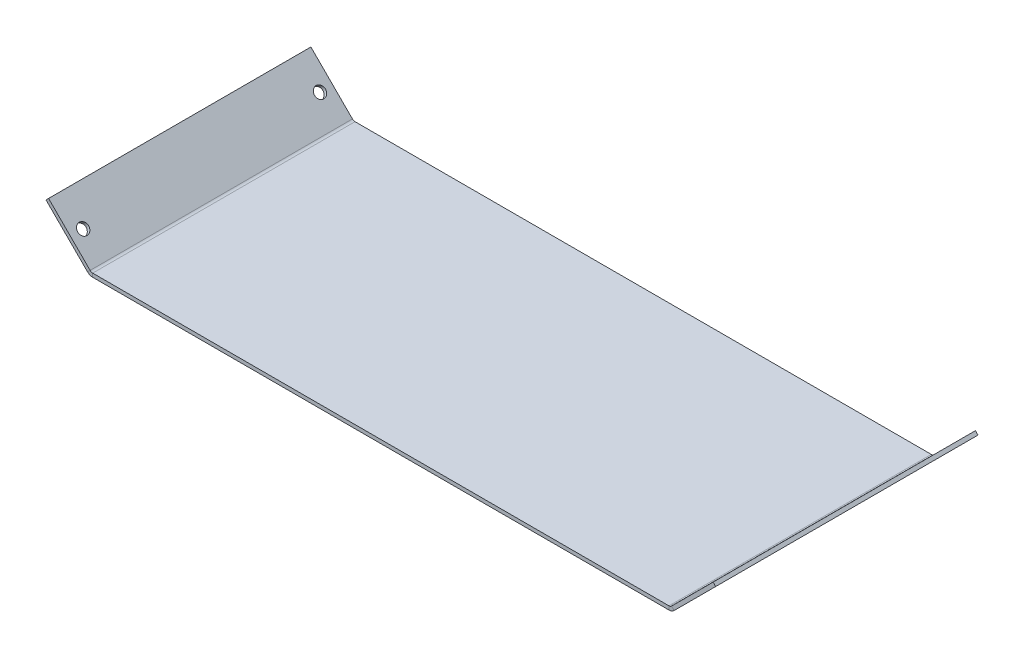
ISO-10303-21;
HEADER;
FILE_DESCRIPTION(('STEP AP214'),'2;1');
FILE_NAME('part.step','',(''),(''),'','','');
FILE_SCHEMA(('AUTOMOTIVE_DESIGN { 1 0 10303 214 1 1 1 1 }'));
ENDSEC;
DATA;
#1=APPLICATION_CONTEXT('core data for automotive mechanical design processes');
#2=APPLICATION_PROTOCOL_DEFINITION('international standard','automotive_design',2000,#1);
#3=PRODUCT_CONTEXT('',#1,'mechanical');
#4=PRODUCT('Part','Part','',(#3));
#5=PRODUCT_RELATED_PRODUCT_CATEGORY('part','',(#4));
#6=PRODUCT_DEFINITION_FORMATION('','',#4);
#7=PRODUCT_DEFINITION_CONTEXT('part definition',#1,'design');
#8=PRODUCT_DEFINITION('design','',#6,#7);
#9=PRODUCT_DEFINITION_SHAPE('','',#8);
#10=(LENGTH_UNIT() NAMED_UNIT(*) SI_UNIT(.MILLI.,.METRE.));
#11=(NAMED_UNIT(*) PLANE_ANGLE_UNIT() SI_UNIT($,.RADIAN.));
#12=(NAMED_UNIT(*) SI_UNIT($,.STERADIAN.) SOLID_ANGLE_UNIT());
#13=UNCERTAINTY_MEASURE_WITH_UNIT(LENGTH_MEASURE(1.E-05),#10,'distance_accuracy_value','');
#14=(GEOMETRIC_REPRESENTATION_CONTEXT(3) GLOBAL_UNCERTAINTY_ASSIGNED_CONTEXT((#13)) GLOBAL_UNIT_ASSIGNED_CONTEXT((#10,
#11,#12)) REPRESENTATION_CONTEXT('',''));
#15=CARTESIAN_POINT('',(0.,0.,0.));
#16=DIRECTION('',(0.,0.,1.));
#17=DIRECTION('',(1.,0.,0.));
#18=AXIS2_PLACEMENT_3D('',#15,#16,#17);
#19=CARTESIAN_POINT('',(0.,-3.175,0.));
#20=DIRECTION('',(0.,1.,0.));
#21=DIRECTION('',(0.,0.,1.));
#22=AXIS2_PLACEMENT_3D('',#19,#20,#21);
#23=PLANE('',#22);
#24=DIRECTION('',(0.,0.,1.));
#25=VECTOR('',#24,1.);
#26=CARTESIAN_POINT('',(-502.194743878931,-3.17500000000002,228.6));
#27=LINE('',#26,#25);
#28=CARTESIAN_POINT('',(-502.194743878931,-3.17500000000002,228.6));
#29=VERTEX_POINT('',#28);
#30=CARTESIAN_POINT('',(-502.194743878931,-3.175,-228.6));
#31=VERTEX_POINT('',#30);
#32=EDGE_CURVE('E142',#29,#31,#27,.F.);
#33=ORIENTED_EDGE('',*,*,#32,.T.);
#34=DIRECTION('',(-1.,0.,0.));
#35=VECTOR('',#34,1.);
#36=CARTESIAN_POINT('',(504.825,-3.175,-228.6));
#37=LINE('',#36,#35);
#38=CARTESIAN_POINT('',(502.194743878931,-3.17499999999999,-228.6));
#39=VERTEX_POINT('',#38);
#40=EDGE_CURVE('E11',#39,#31,#37,.T.);
#41=ORIENTED_EDGE('',*,*,#40,.F.);
#42=DIRECTION('',(0.,0.,-1.));
#43=VECTOR('',#42,1.);
#44=CARTESIAN_POINT('',(502.194743878931,-3.17499999999999,-228.6));
#45=LINE('',#44,#43);
#46=CARTESIAN_POINT('',(502.194743878931,-3.175,228.6));
#47=VERTEX_POINT('',#46);
#48=EDGE_CURVE('E233',#39,#47,#45,.F.);
#49=ORIENTED_EDGE('',*,*,#48,.T.);
#50=DIRECTION('',(1.,0.,0.));
#51=VECTOR('',#50,1.);
#52=CARTESIAN_POINT('',(504.825,-3.175,228.6));
#53=LINE('',#52,#51);
#54=EDGE_CURVE('E52',#29,#47,#53,.T.);
#55=ORIENTED_EDGE('',*,*,#54,.F.);
#56=EDGE_LOOP('',(#33,#41,#49,#55));
#57=FACE_BOUND('',#56,.T.);
#58=ADVANCED_FACE('F43',(#57),#23,.F.);
#59=CARTESIAN_POINT('',(0.,3.175,0.));
#60=DIRECTION('',(0.,1.,0.));
#61=DIRECTION('',(0.,0.,1.));
#62=AXIS2_PLACEMENT_3D('',#59,#60,#61);
#63=PLANE('',#62);
#64=DIRECTION('',(-1.,0.,0.));
#65=VECTOR('',#64,1.);
#66=CARTESIAN_POINT('',(504.825,3.175,-228.6));
#67=LINE('',#66,#65);
#68=CARTESIAN_POINT('',(502.194743878931,3.175,-228.6));
#69=VERTEX_POINT('',#68);
#70=CARTESIAN_POINT('',(-502.194743878931,3.17499999999998,-228.6));
#71=VERTEX_POINT('',#70);
#72=EDGE_CURVE('E47',#69,#71,#67,.T.);
#73=ORIENTED_EDGE('',*,*,#72,.T.);
#74=DIRECTION('',(0.,0.,1.));
#75=VECTOR('',#74,1.);
#76=CARTESIAN_POINT('',(-502.194743878931,3.17499999999998,228.6));
#77=LINE('',#76,#75);
#78=CARTESIAN_POINT('',(-502.194743878931,3.17499999999998,228.6));
#79=VERTEX_POINT('',#78);
#80=EDGE_CURVE('E192',#79,#71,#77,.F.);
#81=ORIENTED_EDGE('',*,*,#80,.F.);
#82=DIRECTION('',(1.,0.,0.));
#83=VECTOR('',#82,1.);
#84=CARTESIAN_POINT('',(504.825,3.175,228.6));
#85=LINE('',#84,#83);
#86=CARTESIAN_POINT('',(502.194743878931,3.17500000000001,228.6));
#87=VERTEX_POINT('',#86);
#88=EDGE_CURVE('E251',#79,#87,#85,.T.);
#89=ORIENTED_EDGE('',*,*,#88,.T.);
#90=DIRECTION('',(0.,0.,-1.));
#91=VECTOR('',#90,1.);
#92=CARTESIAN_POINT('',(502.194743878931,3.17500000000001,-228.6));
#93=LINE('',#92,#91);
#94=EDGE_CURVE('E60',#69,#87,#93,.F.);
#95=ORIENTED_EDGE('',*,*,#94,.F.);
#96=EDGE_LOOP('',(#73,#81,#89,#95));
#97=FACE_BOUND('',#96,.T.);
#98=ADVANCED_FACE('F255',(#97),#63,.T.);
#99=CARTESIAN_POINT('',(504.825,-3.175,228.6));
#100=DIRECTION('',(0.,0.,1.));
#101=DIRECTION('',(1.,0.,0.));
#102=AXIS2_PLACEMENT_3D('',#99,#100,#101);
#103=PLANE('',#102);
#104=ORIENTED_EDGE('',*,*,#88,.F.);
#105=DIRECTION('',(0.,-1.,0.));
#106=VECTOR('',#105,1.);
#107=CARTESIAN_POINT('',(-502.194743878931,3.17499999999998,228.6));
#108=LINE('',#107,#106);
#109=EDGE_CURVE('E188',#79,#29,#108,.T.);
#110=ORIENTED_EDGE('',*,*,#109,.T.);
#111=ORIENTED_EDGE('',*,*,#54,.T.);
#112=DIRECTION('',(0.,-1.,0.));
#113=VECTOR('',#112,1.);
#114=CARTESIAN_POINT('',(502.194743878931,3.17500000000001,228.6));
#115=LINE('',#114,#113);
#116=EDGE_CURVE('E248',#87,#47,#115,.T.);
#117=ORIENTED_EDGE('',*,*,#116,.F.);
#118=EDGE_LOOP('',(#104,#110,#111,#117));
#119=FACE_BOUND('',#118,.T.);
#120=ADVANCED_FACE('F45',(#119),#103,.T.);
#121=CARTESIAN_POINT('',(504.825,-3.175,-228.6));
#122=DIRECTION('',(0.,0.,-1.));
#123=DIRECTION('',(-1.,0.,0.));
#124=AXIS2_PLACEMENT_3D('',#121,#122,#123);
#125=PLANE('',#124);
#126=DIRECTION('',(0.,-1.,0.));
#127=VECTOR('',#126,1.);
#128=CARTESIAN_POINT('',(-502.194743878931,3.17499999999998,-228.6));
#129=LINE('',#128,#127);
#130=EDGE_CURVE('E196',#71,#31,#129,.T.);
#131=ORIENTED_EDGE('',*,*,#130,.F.);
#132=ORIENTED_EDGE('',*,*,#72,.F.);
#133=DIRECTION('',(0.,-1.,0.));
#134=VECTOR('',#133,1.);
#135=CARTESIAN_POINT('',(502.194743878931,3.17500000000001,-228.6));
#136=LINE('',#135,#134);
#137=EDGE_CURVE('E239',#69,#39,#136,.T.);
#138=ORIENTED_EDGE('',*,*,#137,.T.);
#139=ORIENTED_EDGE('',*,*,#40,.T.);
#140=EDGE_LOOP('',(#131,#132,#138,#139));
#141=FACE_BOUND('',#140,.T.);
#142=ADVANCED_FACE('F305',(#141),#125,.T.);
#143=CARTESIAN_POINT('',(502.194743878931,9.525,228.6));
#144=DIRECTION('',(0.,0.,1.));
#145=DIRECTION('',(1.,0.,0.));
#146=AXIS2_PLACEMENT_3D('',#143,#144,#145);
#147=PLANE('',#146);
#148=DIRECTION('',(0.707106781186543,-0.707106781186551,0.));
#149=VECTOR('',#148,1.);
#150=CARTESIAN_POINT('',(506.684871939465,5.03487193946545,228.6));
#151=LINE('',#150,#149);
#152=CARTESIAN_POINT('',(506.684871939465,5.03487193946541,228.6));
#153=VERTEX_POINT('',#152);
#154=CARTESIAN_POINT('',(511.175,0.544743878930762,228.6));
#155=VERTEX_POINT('',#154);
#156=EDGE_CURVE('E199',#153,#155,#151,.T.);
#157=ORIENTED_EDGE('',*,*,#156,.F.);
#158=CARTESIAN_POINT('',(502.194743878931,9.525,228.6));
#159=DIRECTION('',(0.,0.,-1.));
#160=DIRECTION('',(-1.,0.,0.));
#161=AXIS2_PLACEMENT_3D('',#158,#159,#160);
#162=CIRCLE('',#161,6.34999999999999);
#163=EDGE_CURVE('E242',#87,#153,#162,.F.);
#164=ORIENTED_EDGE('',*,*,#163,.F.);
#165=ORIENTED_EDGE('',*,*,#116,.T.);
#166=CARTESIAN_POINT('',(502.194743878931,9.525,228.6));
#167=DIRECTION('',(0.,0.,-1.));
#168=DIRECTION('',(-1.,0.,0.));
#169=AXIS2_PLACEMENT_3D('',#166,#167,#168);
#170=CIRCLE('',#169,12.7);
#171=EDGE_CURVE('E235',#47,#155,#170,.F.);
#172=ORIENTED_EDGE('',*,*,#171,.T.);
#173=EDGE_LOOP('',(#157,#164,#165,#172));
#174=FACE_BOUND('',#173,.T.);
#175=ADVANCED_FACE('F307',(#174),#147,.T.);
#176=CARTESIAN_POINT('',(502.194743878931,9.525,-228.6));
#177=DIRECTION('',(0.,0.,1.));
#178=DIRECTION('',(1.,0.,0.));
#179=AXIS2_PLACEMENT_3D('',#176,#177,#178);
#180=PLANE('',#179);
#181=CARTESIAN_POINT('',(502.194743878931,9.525,-228.6));
#182=DIRECTION('',(0.,0.,-1.));
#183=DIRECTION('',(-1.,0.,0.));
#184=AXIS2_PLACEMENT_3D('',#181,#182,#183);
#185=CIRCLE('',#184,6.34999999999999);
#186=CARTESIAN_POINT('',(506.684871939465,5.03487193946541,-228.6));
#187=VERTEX_POINT('',#186);
#188=EDGE_CURVE('E230',#187,#69,#185,.T.);
#189=ORIENTED_EDGE('',*,*,#188,.F.);
#190=DIRECTION('',(0.707106781186543,-0.707106781186551,0.));
#191=VECTOR('',#190,1.);
#192=CARTESIAN_POINT('',(506.684871939465,5.03487193946545,-228.6));
#193=LINE('',#192,#191);
#194=CARTESIAN_POINT('',(511.175,0.5447438789308,-228.6));
#195=VERTEX_POINT('',#194);
#196=EDGE_CURVE('E203',#187,#195,#193,.T.);
#197=ORIENTED_EDGE('',*,*,#196,.T.);
#198=CARTESIAN_POINT('',(502.194743878931,9.525,-228.6));
#199=DIRECTION('',(0.,0.,-1.));
#200=DIRECTION('',(-1.,0.,0.));
#201=AXIS2_PLACEMENT_3D('',#198,#199,#200);
#202=CIRCLE('',#201,12.7);
#203=EDGE_CURVE('E236',#195,#39,#202,.T.);
#204=ORIENTED_EDGE('',*,*,#203,.T.);
#205=ORIENTED_EDGE('',*,*,#137,.F.);
#206=EDGE_LOOP('',(#189,#197,#204,#205));
#207=FACE_BOUND('',#206,.T.);
#208=ADVANCED_FACE('F303',(#207),#180,.F.);
#209=CARTESIAN_POINT('',(502.194743878931,9.525,-228.6));
#210=DIRECTION('',(0.,0.,-1.));
#211=DIRECTION('',(0.707106781186544,-0.707106781186551,0.));
#212=AXIS2_PLACEMENT_3D('',#209,#210,#211);
#213=CYLINDRICAL_SURFACE('',#212,12.7);
#214=ORIENTED_EDGE('',*,*,#48,.F.);
#215=ORIENTED_EDGE('',*,*,#203,.F.);
#216=DIRECTION('',(0.,0.,-1.));
#217=VECTOR('',#216,1.);
#218=CARTESIAN_POINT('',(511.175,0.544743878930776,0.));
#219=LINE('',#218,#217);
#220=EDGE_CURVE('E206',#155,#195,#219,.T.);
#221=ORIENTED_EDGE('',*,*,#220,.F.);
#222=ORIENTED_EDGE('',*,*,#171,.F.);
#223=EDGE_LOOP('',(#214,#215,#221,#222));
#224=FACE_BOUND('',#223,.T.);
#225=ADVANCED_FACE('F340',(#224),#213,.T.);
#226=CARTESIAN_POINT('',(502.194743878931,9.525,-228.6));
#227=DIRECTION('',(0.,0.,-1.));
#228=DIRECTION('',(0.707106781186544,-0.707106781186551,0.));
#229=AXIS2_PLACEMENT_3D('',#226,#227,#228);
#230=CYLINDRICAL_SURFACE('',#229,6.34999999999999);
#231=ORIENTED_EDGE('',*,*,#94,.T.);
#232=ORIENTED_EDGE('',*,*,#163,.T.);
#233=DIRECTION('',(0.,0.,-1.));
#234=VECTOR('',#233,1.);
#235=CARTESIAN_POINT('',(506.684871939465,5.03487193946545,228.6));
#236=LINE('',#235,#234);
#237=EDGE_CURVE('E201',#153,#187,#236,.T.);
#238=ORIENTED_EDGE('',*,*,#237,.T.);
#239=ORIENTED_EDGE('',*,*,#188,.T.);
#240=EDGE_LOOP('',(#231,#232,#238,#239));
#241=FACE_BOUND('',#240,.T.);
#242=ADVANCED_FACE('F317',(#241),#230,.F.);
#243=CARTESIAN_POINT('',(509.315128060534,-1.31512806053462,-228.6));
#244=DIRECTION('',(0.,0.,-1.));
#245=DIRECTION('',(-1.,0.,0.));
#246=AXIS2_PLACEMENT_3D('',#243,#244,#245);
#247=PLANE('',#246);
#248=DIRECTION('',(-0.707106781186551,-0.707106781186543,0.));
#249=VECTOR('',#248,1.);
#250=CARTESIAN_POINT('',(509.315128060534,-1.31512806053462,-228.6));
#251=LINE('',#250,#249);
#252=CARTESIAN_POINT('',(583.607828027736,72.977571906666,-228.6));
#253=VERTEX_POINT('',#252);
#254=EDGE_CURVE('E218',#253,#195,#251,.T.);
#255=ORIENTED_EDGE('',*,*,#254,.T.);
#256=ORIENTED_EDGE('',*,*,#196,.F.);
#257=DIRECTION('',(-0.707106781186551,-0.707106781186543,0.));
#258=VECTOR('',#257,1.);
#259=CARTESIAN_POINT('',(504.825,3.17499999999998,-228.6));
#260=LINE('',#259,#258);
#261=CARTESIAN_POINT('',(579.117699967201,77.4676999672006,-228.6));
#262=VERTEX_POINT('',#261);
#263=EDGE_CURVE('E215',#262,#187,#260,.T.);
#264=ORIENTED_EDGE('',*,*,#263,.F.);
#265=DIRECTION('',(-0.707106781186544,0.707106781186551,0.));
#266=VECTOR('',#265,1.);
#267=CARTESIAN_POINT('',(583.607828027736,72.977571906666,-228.6));
#268=LINE('',#267,#266);
#269=EDGE_CURVE('E228',#253,#262,#268,.T.);
#270=ORIENTED_EDGE('',*,*,#269,.F.);
#271=EDGE_LOOP('',(#255,#256,#264,#270));
#272=FACE_BOUND('',#271,.T.);
#273=ADVANCED_FACE('F337',(#272),#247,.T.);
#274=CARTESIAN_POINT('',(583.607828027736,72.977571906666,228.6));
#275=DIRECTION('',(0.,0.,1.));
#276=DIRECTION('',(1.,0.,0.));
#277=AXIS2_PLACEMENT_3D('',#274,#275,#276);
#278=PLANE('',#277);
#279=DIRECTION('',(0.707106781186551,0.707106781186543,0.));
#280=VECTOR('',#279,1.);
#281=CARTESIAN_POINT('',(579.117699967201,77.4676999672006,228.6));
#282=LINE('',#281,#280);
#283=CARTESIAN_POINT('',(579.117699967201,77.4676999672006,228.6));
#284=VERTEX_POINT('',#283);
#285=EDGE_CURVE('E211',#153,#284,#282,.T.);
#286=ORIENTED_EDGE('',*,*,#285,.F.);
#287=ORIENTED_EDGE('',*,*,#156,.T.);
#288=DIRECTION('',(0.707106781186551,0.707106781186543,0.));
#289=VECTOR('',#288,1.);
#290=CARTESIAN_POINT('',(583.607828027736,72.977571906666,228.6));
#291=LINE('',#290,#289);
#292=CARTESIAN_POINT('',(583.607828027736,72.977571906666,228.6));
#293=VERTEX_POINT('',#292);
#294=EDGE_CURVE('E212',#155,#293,#291,.T.);
#295=ORIENTED_EDGE('',*,*,#294,.T.);
#296=DIRECTION('',(-0.707106781186544,0.707106781186551,0.));
#297=VECTOR('',#296,1.);
#298=CARTESIAN_POINT('',(583.607828027736,72.977571906666,228.6));
#299=LINE('',#298,#297);
#300=EDGE_CURVE('E221',#293,#284,#299,.T.);
#301=ORIENTED_EDGE('',*,*,#300,.T.);
#302=EDGE_LOOP('',(#286,#287,#295,#301));
#303=FACE_BOUND('',#302,.T.);
#304=ADVANCED_FACE('F323',(#303),#278,.T.);
#305=CARTESIAN_POINT('',(255.315128060532,-255.315128060535,0.));
#306=DIRECTION('',(0.707106781186544,-0.707106781186551,0.));
#307=DIRECTION('',(0.707106781186551,0.707106781186544,0.));
#308=AXIS2_PLACEMENT_3D('',#305,#306,#307);
#309=PLANE('',#308);
#310=CARTESIAN_POINT('',(545.531542074402,34.9012859533329,206.375));
#311=DIRECTION('',(0.707106781186544,-0.707106781186551,0.));
#312=DIRECTION('',(0.707106781186551,0.707106781186544,0.));
#313=AXIS2_PLACEMENT_3D('',#310,#311,#312);
#314=CIRCLE('',#313,9.52500000000005);
#315=CARTESIAN_POINT('',(552.266734165204,41.6364780441348,206.375));
#316=VERTEX_POINT('',#315);
#317=EDGE_CURVE('E272',#316,#316,#314,.T.);
#318=ORIENTED_EDGE('',*,*,#317,.F.);
#319=EDGE_LOOP('',(#318));
#320=FACE_BOUND('',#319,.T.);
#321=CARTESIAN_POINT('',(545.531542074402,34.9012859533329,-206.375));
#322=DIRECTION('',(0.707106781186544,-0.707106781186551,0.));
#323=DIRECTION('',(-0.707106781186551,-0.707106781186544,0.));
#324=AXIS2_PLACEMENT_3D('',#321,#322,#323);
#325=CIRCLE('',#324,9.52500000000005);
#326=CARTESIAN_POINT('',(538.7963499836,28.166093862531,-206.375));
#327=VERTEX_POINT('',#326);
#328=EDGE_CURVE('E644',#327,#327,#325,.T.);
#329=ORIENTED_EDGE('',*,*,#328,.F.);
#330=EDGE_LOOP('',(#329));
#331=FACE_BOUND('',#330,.T.);
#332=ORIENTED_EDGE('',*,*,#294,.F.);
#333=ORIENTED_EDGE('',*,*,#220,.T.);
#334=ORIENTED_EDGE('',*,*,#254,.F.);
#335=DIRECTION('',(0.,0.,-1.));
#336=VECTOR('',#335,1.);
#337=CARTESIAN_POINT('',(583.607828027736,72.977571906666,-228.6));
#338=LINE('',#337,#336);
#339=EDGE_CURVE('E214',#293,#253,#338,.T.);
#340=ORIENTED_EDGE('',*,*,#339,.F.);
#341=EDGE_LOOP('',(#332,#333,#334,#340));
#342=FACE_BOUND('',#341,.T.);
#343=ADVANCED_FACE('F327',(#320,#331,#342),#309,.T.);
#344=CARTESIAN_POINT('',(250.824999999997,-250.825,0.));
#345=DIRECTION('',(0.707106781186544,-0.707106781186551,0.));
#346=DIRECTION('',(0.707106781186551,0.707106781186544,0.));
#347=AXIS2_PLACEMENT_3D('',#344,#345,#346);
#348=PLANE('',#347);
#349=CARTESIAN_POINT('',(541.041414013868,39.3914140138675,206.375));
#350=DIRECTION('',(0.707106781186544,-0.707106781186551,0.));
#351=DIRECTION('',(0.707106781186551,0.707106781186544,0.));
#352=AXIS2_PLACEMENT_3D('',#349,#350,#351);
#353=CIRCLE('',#352,9.52500000000005);
#354=CARTESIAN_POINT('',(547.77660610467,46.1266061046693,206.375));
#355=VERTEX_POINT('',#354);
#356=EDGE_CURVE('E268',#355,#355,#353,.F.);
#357=ORIENTED_EDGE('',*,*,#356,.F.);
#358=EDGE_LOOP('',(#357));
#359=FACE_BOUND('',#358,.T.);
#360=CARTESIAN_POINT('',(541.041414013868,39.3914140138675,-206.375));
#361=DIRECTION('',(0.707106781186544,-0.707106781186551,0.));
#362=DIRECTION('',(0.707106781186551,0.707106781186544,0.));
#363=AXIS2_PLACEMENT_3D('',#360,#361,#362);
#364=CIRCLE('',#363,9.52500000000005);
#365=CARTESIAN_POINT('',(547.77660610467,46.1266061046693,-206.375));
#366=VERTEX_POINT('',#365);
#367=EDGE_CURVE('E641',#366,#366,#364,.F.);
#368=ORIENTED_EDGE('',*,*,#367,.F.);
#369=EDGE_LOOP('',(#368));
#370=FACE_BOUND('',#369,.T.);
#371=ORIENTED_EDGE('',*,*,#237,.F.);
#372=ORIENTED_EDGE('',*,*,#285,.T.);
#373=DIRECTION('',(0.,0.,-1.));
#374=VECTOR('',#373,1.);
#375=CARTESIAN_POINT('',(579.117699967201,77.4676999672006,-228.6));
#376=LINE('',#375,#374);
#377=EDGE_CURVE('E223',#284,#262,#376,.T.);
#378=ORIENTED_EDGE('',*,*,#377,.T.);
#379=ORIENTED_EDGE('',*,*,#263,.T.);
#380=EDGE_LOOP('',(#371,#372,#378,#379));
#381=FACE_BOUND('',#380,.T.);
#382=ADVANCED_FACE('F334',(#359,#370,#381),#348,.F.);
#383=CARTESIAN_POINT('',(583.607828027736,72.977571906666,-228.6));
#384=DIRECTION('',(0.707106781186551,0.707106781186544,0.));
#385=DIRECTION('',(-0.707106781186544,0.707106781186551,0.));
#386=AXIS2_PLACEMENT_3D('',#383,#384,#385);
#387=PLANE('',#386);
#388=ORIENTED_EDGE('',*,*,#377,.F.);
#389=ORIENTED_EDGE('',*,*,#300,.F.);
#390=ORIENTED_EDGE('',*,*,#339,.T.);
#391=ORIENTED_EDGE('',*,*,#269,.T.);
#392=EDGE_LOOP('',(#388,#389,#390,#391));
#393=FACE_BOUND('',#392,.T.);
#394=ADVANCED_FACE('F331',(#393),#387,.T.);
#395=CARTESIAN_POINT('',(-502.194743878931,9.525,-228.6));
#396=DIRECTION('',(0.,0.,-1.));
#397=DIRECTION('',(-1.,0.,0.));
#398=AXIS2_PLACEMENT_3D('',#395,#396,#397);
#399=PLANE('',#398);
#400=DIRECTION('',(-0.707106781186543,-0.707106781186551,0.));
#401=VECTOR('',#400,1.);
#402=CARTESIAN_POINT('',(-506.684871939465,5.03487193946545,-228.6));
#403=LINE('',#402,#401);
#404=CARTESIAN_POINT('',(-506.684871939465,5.03487193946539,-228.6));
#405=VERTEX_POINT('',#404);
#406=CARTESIAN_POINT('',(-511.175,0.544743878930835,-228.6));
#407=VERTEX_POINT('',#406);
#408=EDGE_CURVE('E265',#405,#407,#403,.T.);
#409=ORIENTED_EDGE('',*,*,#408,.F.);
#410=CARTESIAN_POINT('',(-502.194743878931,9.525,-228.6));
#411=DIRECTION('',(0.,0.,1.));
#412=DIRECTION('',(1.,0.,0.));
#413=AXIS2_PLACEMENT_3D('',#410,#411,#412);
#414=CIRCLE('',#413,6.35000000000002);
#415=EDGE_CURVE('E145',#71,#405,#414,.F.);
#416=ORIENTED_EDGE('',*,*,#415,.F.);
#417=ORIENTED_EDGE('',*,*,#130,.T.);
#418=CARTESIAN_POINT('',(-502.194743878931,9.525,-228.6));
#419=DIRECTION('',(0.,0.,1.));
#420=DIRECTION('',(1.,0.,0.));
#421=AXIS2_PLACEMENT_3D('',#418,#419,#420);
#422=CIRCLE('',#421,12.7);
#423=EDGE_CURVE('E187',#31,#407,#422,.F.);
#424=ORIENTED_EDGE('',*,*,#423,.T.);
#425=EDGE_LOOP('',(#409,#416,#417,#424));
#426=FACE_BOUND('',#425,.T.);
#427=ADVANCED_FACE('F263',(#426),#399,.T.);
#428=CARTESIAN_POINT('',(-502.194743878931,9.525,228.6));
#429=DIRECTION('',(0.,0.,-1.));
#430=DIRECTION('',(-1.,0.,0.));
#431=AXIS2_PLACEMENT_3D('',#428,#429,#430);
#432=PLANE('',#431);
#433=CARTESIAN_POINT('',(-502.194743878931,9.525,228.6));
#434=DIRECTION('',(0.,0.,1.));
#435=DIRECTION('',(1.,0.,0.));
#436=AXIS2_PLACEMENT_3D('',#433,#434,#435);
#437=CIRCLE('',#436,6.35000000000002);
#438=CARTESIAN_POINT('',(-506.684871939465,5.03487193946539,228.6));
#439=VERTEX_POINT('',#438);
#440=EDGE_CURVE('E152',#439,#79,#437,.T.);
#441=ORIENTED_EDGE('',*,*,#440,.F.);
#442=DIRECTION('',(-0.707106781186543,-0.707106781186551,0.));
#443=VECTOR('',#442,1.);
#444=CARTESIAN_POINT('',(-506.684871939465,5.03487193946545,228.6));
#445=LINE('',#444,#443);
#446=CARTESIAN_POINT('',(-511.175,0.544743878930697,228.6));
#447=VERTEX_POINT('',#446);
#448=EDGE_CURVE('E149',#439,#447,#445,.T.);
#449=ORIENTED_EDGE('',*,*,#448,.T.);
#450=CARTESIAN_POINT('',(-502.194743878931,9.525,228.6));
#451=DIRECTION('',(0.,0.,1.));
#452=DIRECTION('',(1.,0.,0.));
#453=AXIS2_PLACEMENT_3D('',#450,#451,#452);
#454=CIRCLE('',#453,12.7);
#455=EDGE_CURVE('E135',#447,#29,#454,.T.);
#456=ORIENTED_EDGE('',*,*,#455,.T.);
#457=ORIENTED_EDGE('',*,*,#109,.F.);
#458=EDGE_LOOP('',(#441,#449,#456,#457));
#459=FACE_BOUND('',#458,.T.);
#460=ADVANCED_FACE('F150',(#459),#432,.F.);
#461=CARTESIAN_POINT('',(-502.194743878931,9.525,228.6));
#462=DIRECTION('',(0.,0.,1.));
#463=DIRECTION('',(-0.707106781186544,-0.707106781186551,0.));
#464=AXIS2_PLACEMENT_3D('',#461,#462,#463);
#465=CYLINDRICAL_SURFACE('',#464,12.7);
#466=ORIENTED_EDGE('',*,*,#32,.F.);
#467=ORIENTED_EDGE('',*,*,#455,.F.);
#468=DIRECTION('',(0.,0.,-1.));
#469=VECTOR('',#468,1.);
#470=CARTESIAN_POINT('',(-511.175,0.54474387893072,0.));
#471=LINE('',#470,#469);
#472=EDGE_CURVE('E140',#447,#407,#471,.T.);
#473=ORIENTED_EDGE('',*,*,#472,.T.);
#474=ORIENTED_EDGE('',*,*,#423,.F.);
#475=EDGE_LOOP('',(#466,#467,#473,#474));
#476=FACE_BOUND('',#475,.T.);
#477=ADVANCED_FACE('F137',(#476),#465,.T.);
#478=CARTESIAN_POINT('',(-502.194743878931,9.525,228.6));
#479=DIRECTION('',(0.,0.,1.));
#480=DIRECTION('',(-0.707106781186544,-0.707106781186551,0.));
#481=AXIS2_PLACEMENT_3D('',#478,#479,#480);
#482=CYLINDRICAL_SURFACE('',#481,6.35000000000002);
#483=ORIENTED_EDGE('',*,*,#80,.T.);
#484=ORIENTED_EDGE('',*,*,#415,.T.);
#485=DIRECTION('',(0.,0.,1.));
#486=VECTOR('',#485,1.);
#487=CARTESIAN_POINT('',(-506.684871939465,5.03487193946545,-228.6));
#488=LINE('',#487,#486);
#489=EDGE_CURVE('E157',#405,#439,#488,.T.);
#490=ORIENTED_EDGE('',*,*,#489,.T.);
#491=ORIENTED_EDGE('',*,*,#440,.T.);
#492=EDGE_LOOP('',(#483,#484,#490,#491));
#493=FACE_BOUND('',#492,.T.);
#494=ADVANCED_FACE('F260',(#493),#482,.F.);
#495=CARTESIAN_POINT('',(-509.315128060534,-1.31512806053462,-228.6));
#496=DIRECTION('',(0.,0.,-1.));
#497=DIRECTION('',(-1.,0.,0.));
#498=AXIS2_PLACEMENT_3D('',#495,#496,#497);
#499=PLANE('',#498);
#500=DIRECTION('',(-0.707106781186551,0.707106781186543,0.));
#501=VECTOR('',#500,1.);
#502=CARTESIAN_POINT('',(-504.825,3.17499999999998,-228.6));
#503=LINE('',#502,#501);
#504=CARTESIAN_POINT('',(-579.117699967201,77.4676999672006,-228.6));
#505=VERTEX_POINT('',#504);
#506=EDGE_CURVE('E167',#405,#505,#503,.T.);
#507=ORIENTED_EDGE('',*,*,#506,.F.);
#508=ORIENTED_EDGE('',*,*,#408,.T.);
#509=DIRECTION('',(-0.707106781186551,0.707106781186543,0.));
#510=VECTOR('',#509,1.);
#511=CARTESIAN_POINT('',(-509.315128060534,-1.31512806053462,-228.6));
#512=LINE('',#511,#510);
#513=CARTESIAN_POINT('',(-583.607828027736,72.977571906666,-228.6));
#514=VERTEX_POINT('',#513);
#515=EDGE_CURVE('E166',#407,#514,#512,.T.);
#516=ORIENTED_EDGE('',*,*,#515,.T.);
#517=DIRECTION('',(0.707106781186544,0.707106781186551,0.));
#518=VECTOR('',#517,1.);
#519=CARTESIAN_POINT('',(-583.607828027736,72.977571906666,-228.6));
#520=LINE('',#519,#518);
#521=EDGE_CURVE('E171',#514,#505,#520,.T.);
#522=ORIENTED_EDGE('',*,*,#521,.T.);
#523=EDGE_LOOP('',(#507,#508,#516,#522));
#524=FACE_BOUND('',#523,.T.);
#525=ADVANCED_FACE('F275',(#524),#499,.T.);
#526=CARTESIAN_POINT('',(-583.607828027736,72.977571906666,228.6));
#527=DIRECTION('',(0.,0.,1.));
#528=DIRECTION('',(1.,0.,0.));
#529=AXIS2_PLACEMENT_3D('',#526,#527,#528);
#530=PLANE('',#529);
#531=DIRECTION('',(0.707106781186551,-0.707106781186543,0.));
#532=VECTOR('',#531,1.);
#533=CARTESIAN_POINT('',(-583.607828027736,72.977571906666,228.6));
#534=LINE('',#533,#532);
#535=CARTESIAN_POINT('',(-583.607828027736,72.977571906666,228.6));
#536=VERTEX_POINT('',#535);
#537=EDGE_CURVE('E164',#536,#447,#534,.T.);
#538=ORIENTED_EDGE('',*,*,#537,.T.);
#539=ORIENTED_EDGE('',*,*,#448,.F.);
#540=DIRECTION('',(0.707106781186551,-0.707106781186543,0.));
#541=VECTOR('',#540,1.);
#542=CARTESIAN_POINT('',(-579.117699967201,77.4676999672006,228.6));
#543=LINE('',#542,#541);
#544=CARTESIAN_POINT('',(-579.117699967201,77.4676999672006,228.6));
#545=VERTEX_POINT('',#544);
#546=EDGE_CURVE('E183',#545,#439,#543,.T.);
#547=ORIENTED_EDGE('',*,*,#546,.F.);
#548=DIRECTION('',(0.707106781186544,0.707106781186551,0.));
#549=VECTOR('',#548,1.);
#550=CARTESIAN_POINT('',(-583.607828027736,72.977571906666,228.6));
#551=LINE('',#550,#549);
#552=EDGE_CURVE('E170',#536,#545,#551,.T.);
#553=ORIENTED_EDGE('',*,*,#552,.F.);
#554=EDGE_LOOP('',(#538,#539,#547,#553));
#555=FACE_BOUND('',#554,.T.);
#556=ADVANCED_FACE('F169',(#555),#530,.T.);
#557=CARTESIAN_POINT('',(-255.315128060532,-255.315128060535,0.));
#558=DIRECTION('',(0.707106781186544,0.707106781186552,0.));
#559=DIRECTION('',(-0.707106781186551,0.707106781186544,0.));
#560=AXIS2_PLACEMENT_3D('',#557,#558,#559);
#561=PLANE('',#560);
#562=CARTESIAN_POINT('',(-545.531542074402,34.901285953333,-206.375));
#563=DIRECTION('',(-0.707106781186544,-0.707106781186551,0.));
#564=DIRECTION('',(0.707106781186551,-0.707106781186544,0.));
#565=AXIS2_PLACEMENT_3D('',#562,#563,#564);
#566=CIRCLE('',#565,9.525);
#567=CARTESIAN_POINT('',(-538.7963499836,28.1660938625311,-206.375));
#568=VERTEX_POINT('',#567);
#569=EDGE_CURVE('E655',#568,#568,#566,.T.);
#570=ORIENTED_EDGE('',*,*,#569,.F.);
#571=EDGE_LOOP('',(#570));
#572=FACE_BOUND('',#571,.T.);
#573=CARTESIAN_POINT('',(-545.531542074402,34.9012859533331,206.375));
#574=DIRECTION('',(-0.707106781186544,-0.707106781186551,0.));
#575=DIRECTION('',(-0.707106781186551,0.707106781186544,0.));
#576=AXIS2_PLACEMENT_3D('',#573,#574,#575);
#577=CIRCLE('',#576,9.525);
#578=CARTESIAN_POINT('',(-552.266734165204,41.636478044135,206.375));
#579=VERTEX_POINT('',#578);
#580=EDGE_CURVE('E652',#579,#579,#577,.T.);
#581=ORIENTED_EDGE('',*,*,#580,.F.);
#582=EDGE_LOOP('',(#581));
#583=FACE_BOUND('',#582,.T.);
#584=ORIENTED_EDGE('',*,*,#472,.F.);
#585=ORIENTED_EDGE('',*,*,#537,.F.);
#586=DIRECTION('',(0.,0.,1.));
#587=VECTOR('',#586,1.);
#588=CARTESIAN_POINT('',(-583.607828027736,72.977571906666,-228.6));
#589=LINE('',#588,#587);
#590=EDGE_CURVE('E172',#514,#536,#589,.T.);
#591=ORIENTED_EDGE('',*,*,#590,.F.);
#592=ORIENTED_EDGE('',*,*,#515,.F.);
#593=EDGE_LOOP('',(#584,#585,#591,#592));
#594=FACE_BOUND('',#593,.T.);
#595=ADVANCED_FACE('F162',(#572,#583,#594),#561,.F.);
#596=CARTESIAN_POINT('',(-250.824999999997,-250.825,0.));
#597=DIRECTION('',(0.707106781186544,0.707106781186552,0.));
#598=DIRECTION('',(-0.707106781186551,0.707106781186544,0.));
#599=AXIS2_PLACEMENT_3D('',#596,#597,#598);
#600=PLANE('',#599);
#601=CARTESIAN_POINT('',(-541.041414013868,39.3914140138674,-206.375));
#602=DIRECTION('',(0.707106781186544,0.707106781186552,0.));
#603=DIRECTION('',(-0.707106781186551,0.707106781186544,0.));
#604=AXIS2_PLACEMENT_3D('',#601,#602,#603);
#605=CIRCLE('',#604,9.525);
#606=CARTESIAN_POINT('',(-547.77660610467,46.1266061046692,-206.375));
#607=VERTEX_POINT('',#606);
#608=EDGE_CURVE('E649',#607,#607,#605,.F.);
#609=ORIENTED_EDGE('',*,*,#608,.T.);
#610=EDGE_LOOP('',(#609));
#611=FACE_BOUND('',#610,.T.);
#612=CARTESIAN_POINT('',(-541.041414013868,39.3914140138675,206.375));
#613=DIRECTION('',(0.707106781186544,0.707106781186552,0.));
#614=DIRECTION('',(-0.707106781186551,0.707106781186544,0.));
#615=AXIS2_PLACEMENT_3D('',#612,#613,#614);
#616=CIRCLE('',#615,9.525);
#617=CARTESIAN_POINT('',(-547.77660610467,46.1266061046693,206.375));
#618=VERTEX_POINT('',#617);
#619=EDGE_CURVE('E656',#618,#618,#616,.F.);
#620=ORIENTED_EDGE('',*,*,#619,.T.);
#621=EDGE_LOOP('',(#620));
#622=FACE_BOUND('',#621,.T.);
#623=ORIENTED_EDGE('',*,*,#546,.T.);
#624=ORIENTED_EDGE('',*,*,#489,.F.);
#625=ORIENTED_EDGE('',*,*,#506,.T.);
#626=DIRECTION('',(0.,0.,1.));
#627=VECTOR('',#626,1.);
#628=CARTESIAN_POINT('',(-579.117699967201,77.4676999672006,-228.6));
#629=LINE('',#628,#627);
#630=EDGE_CURVE('E180',#505,#545,#629,.T.);
#631=ORIENTED_EDGE('',*,*,#630,.T.);
#632=EDGE_LOOP('',(#623,#624,#625,#631));
#633=FACE_BOUND('',#632,.T.);
#634=ADVANCED_FACE('F280',(#611,#622,#633),#600,.T.);
#635=CARTESIAN_POINT('',(-583.607828027736,72.977571906666,-228.6));
#636=DIRECTION('',(-0.707106781186551,0.707106781186544,0.));
#637=DIRECTION('',(-0.707106781186544,-0.707106781186551,0.));
#638=AXIS2_PLACEMENT_3D('',#635,#636,#637);
#639=PLANE('',#638);
#640=ORIENTED_EDGE('',*,*,#630,.F.);
#641=ORIENTED_EDGE('',*,*,#521,.F.);
#642=ORIENTED_EDGE('',*,*,#590,.T.);
#643=ORIENTED_EDGE('',*,*,#552,.T.);
#644=EDGE_LOOP('',(#640,#641,#642,#643));
#645=FACE_BOUND('',#644,.T.);
#646=ADVANCED_FACE('F278',(#645),#639,.T.);
#647=CARTESIAN_POINT('',(521.991414013868,58.4414140138677,-206.375));
#648=DIRECTION('',(0.707106781186544,-0.707106781186551,0.));
#649=DIRECTION('',(0.707106781186551,0.707106781186544,0.));
#650=AXIS2_PLACEMENT_3D('',#647,#648,#649);
#651=CYLINDRICAL_SURFACE('',#650,9.52500000000005);
#652=ORIENTED_EDGE('',*,*,#367,.T.);
#653=EDGE_LOOP('',(#652));
#654=FACE_BOUND('',#653,.T.);
#655=ORIENTED_EDGE('',*,*,#328,.T.);
#656=EDGE_LOOP('',(#655));
#657=FACE_BOUND('',#656,.T.);
#658=ADVANCED_FACE('F288',(#654,#657),#651,.F.);
#659=CARTESIAN_POINT('',(521.991414013868,58.4414140138677,206.375));
#660=DIRECTION('',(0.707106781186544,-0.707106781186551,0.));
#661=DIRECTION('',(0.707106781186551,0.707106781186544,0.));
#662=AXIS2_PLACEMENT_3D('',#659,#660,#661);
#663=CYLINDRICAL_SURFACE('',#662,9.52500000000005);
#664=ORIENTED_EDGE('',*,*,#356,.T.);
#665=EDGE_LOOP('',(#664));
#666=FACE_BOUND('',#665,.T.);
#667=ORIENTED_EDGE('',*,*,#317,.T.);
#668=EDGE_LOOP('',(#667));
#669=FACE_BOUND('',#668,.T.);
#670=ADVANCED_FACE('F387',(#666,#669),#663,.F.);
#671=CARTESIAN_POINT('',(-521.991414013868,58.4414140138677,206.375));
#672=DIRECTION('',(-0.707106781186544,-0.707106781186551,0.));
#673=DIRECTION('',(0.707106781186551,-0.707106781186544,0.));
#674=AXIS2_PLACEMENT_3D('',#671,#672,#673);
#675=CYLINDRICAL_SURFACE('',#674,9.525);
#676=ORIENTED_EDGE('',*,*,#580,.T.);
#677=EDGE_LOOP('',(#676));
#678=FACE_BOUND('',#677,.T.);
#679=ORIENTED_EDGE('',*,*,#619,.F.);
#680=EDGE_LOOP('',(#679));
#681=FACE_BOUND('',#680,.T.);
#682=ADVANCED_FACE('F398',(#678,#681),#675,.F.);
#683=CARTESIAN_POINT('',(-521.991414013868,58.4414140138675,-206.375));
#684=DIRECTION('',(-0.707106781186544,-0.707106781186551,0.));
#685=DIRECTION('',(0.707106781186551,-0.707106781186544,0.));
#686=AXIS2_PLACEMENT_3D('',#683,#684,#685);
#687=CYLINDRICAL_SURFACE('',#686,9.525);
#688=ORIENTED_EDGE('',*,*,#569,.T.);
#689=EDGE_LOOP('',(#688));
#690=FACE_BOUND('',#689,.T.);
#691=ORIENTED_EDGE('',*,*,#608,.F.);
#692=EDGE_LOOP('',(#691));
#693=FACE_BOUND('',#692,.T.);
#694=ADVANCED_FACE('F403',(#690,#693),#687,.F.);
#695=CLOSED_SHELL('',(#58,#98,#120,#142,#175,#208,#225,#242,#273,#304,#343,#382,#394,#427,#460,
#477,#494,#525,#556,#595,#634,#646,#658,#670,#682,#694));
#696=MANIFOLD_SOLID_BREP('B2',#695);
#697=ADVANCED_BREP_SHAPE_REPRESENTATION('',(#18,#696),#14);
#698=SHAPE_DEFINITION_REPRESENTATION(#9,#697);
ENDSEC;
END-ISO-10303-21;
